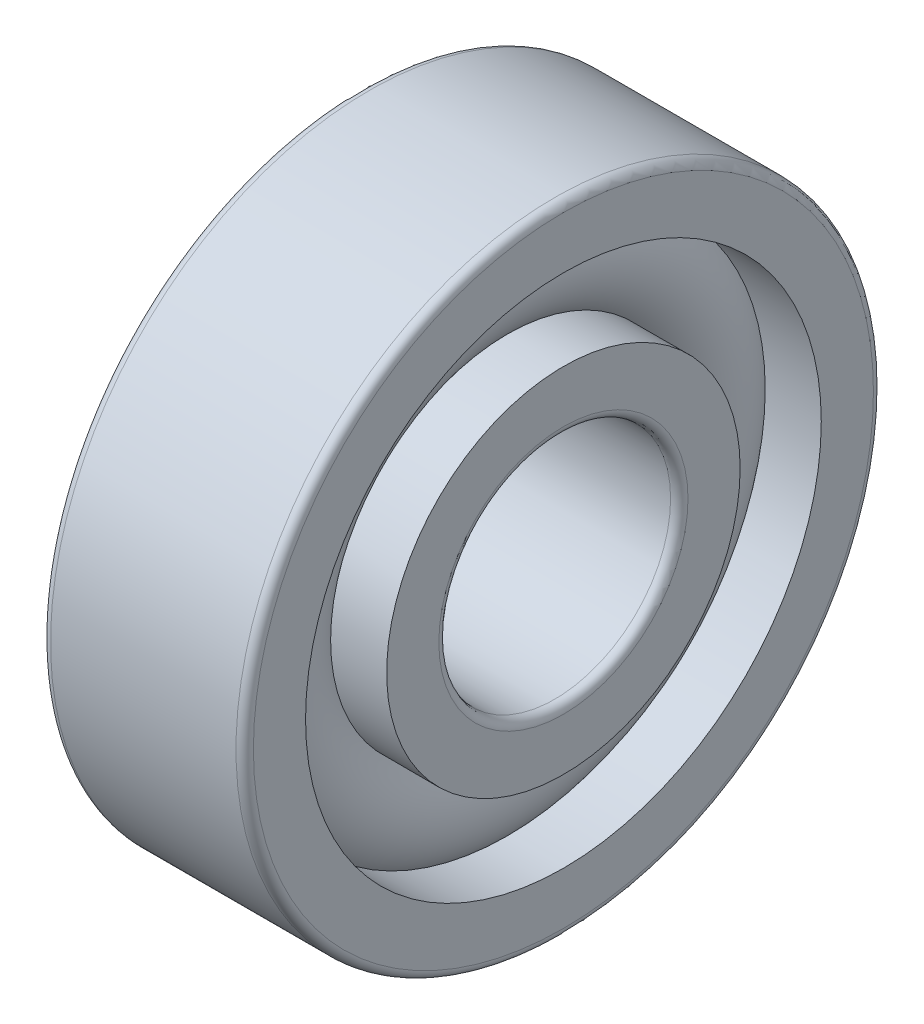
ISO-10303-21;
HEADER;
FILE_DESCRIPTION(('STEP AP214'),'2;1');
FILE_NAME('part.step','',(''),(''),'','','');
FILE_SCHEMA(('AUTOMOTIVE_DESIGN { 1 0 10303 214 1 1 1 1 }'));
ENDSEC;
DATA;
#1=APPLICATION_CONTEXT('core data for automotive mechanical design processes');
#2=APPLICATION_PROTOCOL_DEFINITION('international standard','automotive_design',2000,#1);
#3=PRODUCT_CONTEXT('',#1,'mechanical');
#4=PRODUCT('Part','Part','',(#3));
#5=PRODUCT_RELATED_PRODUCT_CATEGORY('part','',(#4));
#6=PRODUCT_DEFINITION_FORMATION('','',#4);
#7=PRODUCT_DEFINITION_CONTEXT('part definition',#1,'design');
#8=PRODUCT_DEFINITION('design','',#6,#7);
#9=PRODUCT_DEFINITION_SHAPE('','',#8);
#10=(LENGTH_UNIT() NAMED_UNIT(*) SI_UNIT(.MILLI.,.METRE.));
#11=(NAMED_UNIT(*) PLANE_ANGLE_UNIT() SI_UNIT($,.RADIAN.));
#12=(NAMED_UNIT(*) SI_UNIT($,.STERADIAN.) SOLID_ANGLE_UNIT());
#13=UNCERTAINTY_MEASURE_WITH_UNIT(LENGTH_MEASURE(1.E-05),#10,'distance_accuracy_value','');
#14=(GEOMETRIC_REPRESENTATION_CONTEXT(3) GLOBAL_UNCERTAINTY_ASSIGNED_CONTEXT((#13)) GLOBAL_UNIT_ASSIGNED_CONTEXT((#10,
#11,#12)) REPRESENTATION_CONTEXT('',''));
#15=CARTESIAN_POINT('',(0.,0.,0.));
#16=DIRECTION('',(0.,0.,1.));
#17=DIRECTION('',(1.,0.,0.));
#18=AXIS2_PLACEMENT_3D('',#15,#16,#17);
#19=CARTESIAN_POINT('',(0.,0.,0.));
#20=DIRECTION('',(-1.,0.,0.));
#21=DIRECTION('',(0.,0.,1.));
#22=AXIS2_PLACEMENT_3D('',#19,#20,#21);
#23=TOROIDAL_SURFACE('',#22,7.5,2.1);
#24=CARTESIAN_POINT('',(1.56524758424985,0.,0.));
#25=DIRECTION('',(-1.,0.,0.));
#26=DIRECTION('',(0.,0.,1.));
#27=AXIS2_PLACEMENT_3D('',#24,#25,#26);
#28=CIRCLE('',#27,8.90000000000001);
#29=CARTESIAN_POINT('',(1.56524758424985,0.,8.90000000000001));
#30=VERTEX_POINT('',#29);
#31=EDGE_CURVE('E36',#30,#30,#28,.F.);
#32=ORIENTED_EDGE('',*,*,#31,.T.);
#33=EDGE_LOOP('',(#32));
#34=FACE_BOUND('',#33,.T.);
#35=CARTESIAN_POINT('',(1.56524758424985,0.,0.));
#36=DIRECTION('',(-1.,0.,0.));
#37=DIRECTION('',(0.,0.,1.));
#38=AXIS2_PLACEMENT_3D('',#35,#36,#37);
#39=CIRCLE('',#38,6.1);
#40=CARTESIAN_POINT('',(1.56524758424985,0.,6.1));
#41=VERTEX_POINT('',#40);
#42=EDGE_CURVE('E10',#41,#41,#39,.T.);
#43=ORIENTED_EDGE('',*,*,#42,.T.);
#44=EDGE_LOOP('',(#43));
#45=FACE_BOUND('',#44,.T.);
#46=ADVANCED_FACE('F32',(#34,#45),#23,.T.);
#47=CARTESIAN_POINT('',(-20.6375,0.,0.));
#48=DIRECTION('',(1.,0.,0.));
#49=DIRECTION('',(0.,0.,-1.));
#50=AXIS2_PLACEMENT_3D('',#47,#48,#49);
#51=CYLINDRICAL_SURFACE('',#50,6.1);
#52=CARTESIAN_POINT('',(3.5,0.,0.));
#53=DIRECTION('',(1.,0.,0.));
#54=DIRECTION('',(0.,0.,-1.));
#55=AXIS2_PLACEMENT_3D('',#52,#53,#54);
#56=CIRCLE('',#55,6.1);
#57=CARTESIAN_POINT('',(3.5,0.,-6.1));
#58=VERTEX_POINT('',#57);
#59=EDGE_CURVE('E45',#58,#58,#56,.T.);
#60=ORIENTED_EDGE('',*,*,#59,.F.);
#61=EDGE_LOOP('',(#60));
#62=FACE_BOUND('',#61,.T.);
#63=ORIENTED_EDGE('',*,*,#42,.F.);
#64=EDGE_LOOP('',(#63));
#65=FACE_BOUND('',#64,.T.);
#66=ADVANCED_FACE('F84',(#62,#65),#51,.T.);
#67=CARTESIAN_POINT('',(-20.6375,0.,0.));
#68=DIRECTION('',(1.,0.,0.));
#69=DIRECTION('',(0.,0.,-1.));
#70=AXIS2_PLACEMENT_3D('',#67,#68,#69);
#71=CYLINDRICAL_SURFACE('',#70,6.1);
#72=CARTESIAN_POINT('',(-3.5,0.,0.));
#73=DIRECTION('',(1.,0.,0.));
#74=DIRECTION('',(0.,0.,-1.));
#75=AXIS2_PLACEMENT_3D('',#72,#73,#74);
#76=CIRCLE('',#75,6.1);
#77=CARTESIAN_POINT('',(-3.5,0.,-6.1));
#78=VERTEX_POINT('',#77);
#79=EDGE_CURVE('E54',#78,#78,#76,.T.);
#80=ORIENTED_EDGE('',*,*,#79,.T.);
#81=EDGE_LOOP('',(#80));
#82=FACE_BOUND('',#81,.T.);
#83=CARTESIAN_POINT('',(-1.56524758424985,0.,0.));
#84=DIRECTION('',(1.,0.,0.));
#85=DIRECTION('',(0.,0.,-1.));
#86=AXIS2_PLACEMENT_3D('',#83,#84,#85);
#87=CIRCLE('',#86,6.1);
#88=CARTESIAN_POINT('',(-1.56524758424985,0.,-6.1));
#89=VERTEX_POINT('',#88);
#90=EDGE_CURVE('E40',#89,#89,#87,.T.);
#91=ORIENTED_EDGE('',*,*,#90,.F.);
#92=EDGE_LOOP('',(#91));
#93=FACE_BOUND('',#92,.T.);
#94=ADVANCED_FACE('F87',(#82,#93),#71,.T.);
#95=CARTESIAN_POINT('',(3.5,4.3,0.));
#96=DIRECTION('',(1.,0.,0.));
#97=DIRECTION('',(0.,0.,-1.));
#98=AXIS2_PLACEMENT_3D('',#95,#96,#97);
#99=PLANE('',#98);
#100=ORIENTED_EDGE('',*,*,#59,.T.);
#101=EDGE_LOOP('',(#100));
#102=FACE_BOUND('',#101,.T.);
#103=CARTESIAN_POINT('',(3.5,0.,0.));
#104=DIRECTION('',(1.,0.,0.));
#105=DIRECTION('',(0.,0.,-1.));
#106=AXIS2_PLACEMENT_3D('',#103,#104,#105);
#107=CIRCLE('',#106,4.3);
#108=CARTESIAN_POINT('',(3.5,0.,-4.3));
#109=VERTEX_POINT('',#108);
#110=EDGE_CURVE('E76',#109,#109,#107,.T.);
#111=ORIENTED_EDGE('',*,*,#110,.F.);
#112=EDGE_LOOP('',(#111));
#113=FACE_BOUND('',#112,.T.);
#114=ADVANCED_FACE('F81',(#102,#113),#99,.T.);
#115=CARTESIAN_POINT('',(3.2,0.,0.));
#116=DIRECTION('',(1.,0.,0.));
#117=DIRECTION('',(0.,0.,-1.));
#118=AXIS2_PLACEMENT_3D('',#115,#116,#117);
#119=TOROIDAL_SURFACE('',#118,4.3,0.3);
#120=ORIENTED_EDGE('',*,*,#110,.T.);
#121=EDGE_LOOP('',(#120));
#122=FACE_BOUND('',#121,.T.);
#123=CARTESIAN_POINT('',(3.2,0.,0.));
#124=DIRECTION('',(1.,0.,0.));
#125=DIRECTION('',(0.,0.,-1.));
#126=AXIS2_PLACEMENT_3D('',#123,#124,#125);
#127=CIRCLE('',#126,4.);
#128=CARTESIAN_POINT('',(3.2,0.,-4.));
#129=VERTEX_POINT('',#128);
#130=EDGE_CURVE('E73',#129,#129,#127,.T.);
#131=ORIENTED_EDGE('',*,*,#130,.F.);
#132=EDGE_LOOP('',(#131));
#133=FACE_BOUND('',#132,.T.);
#134=ADVANCED_FACE('F98',(#122,#133),#119,.T.);
#135=CARTESIAN_POINT('',(-20.6375,0.,0.));
#136=DIRECTION('',(1.,0.,0.));
#137=DIRECTION('',(0.,0.,-1.));
#138=AXIS2_PLACEMENT_3D('',#135,#136,#137);
#139=CYLINDRICAL_SURFACE('',#138,4.);
#140=ORIENTED_EDGE('',*,*,#130,.T.);
#141=EDGE_LOOP('',(#140));
#142=FACE_BOUND('',#141,.T.);
#143=CARTESIAN_POINT('',(-3.2,0.,0.));
#144=DIRECTION('',(1.,0.,0.));
#145=DIRECTION('',(0.,0.,-1.));
#146=AXIS2_PLACEMENT_3D('',#143,#144,#145);
#147=CIRCLE('',#146,4.);
#148=CARTESIAN_POINT('',(-3.2,0.,-4.));
#149=VERTEX_POINT('',#148);
#150=EDGE_CURVE('E70',#149,#149,#147,.T.);
#151=ORIENTED_EDGE('',*,*,#150,.F.);
#152=EDGE_LOOP('',(#151));
#153=FACE_BOUND('',#152,.T.);
#154=ADVANCED_FACE('F101',(#142,#153),#139,.F.);
#155=CARTESIAN_POINT('',(-3.2,0.,0.));
#156=DIRECTION('',(1.,0.,0.));
#157=DIRECTION('',(0.,0.,-1.));
#158=AXIS2_PLACEMENT_3D('',#155,#156,#157);
#159=TOROIDAL_SURFACE('',#158,4.3,0.3);
#160=ORIENTED_EDGE('',*,*,#150,.T.);
#161=EDGE_LOOP('',(#160));
#162=FACE_BOUND('',#161,.T.);
#163=CARTESIAN_POINT('',(-3.5,0.,0.));
#164=DIRECTION('',(1.,0.,0.));
#165=DIRECTION('',(0.,0.,-1.));
#166=AXIS2_PLACEMENT_3D('',#163,#164,#165);
#167=CIRCLE('',#166,4.3);
#168=CARTESIAN_POINT('',(-3.5,0.,-4.3));
#169=VERTEX_POINT('',#168);
#170=EDGE_CURVE('E67',#169,#169,#167,.T.);
#171=ORIENTED_EDGE('',*,*,#170,.F.);
#172=EDGE_LOOP('',(#171));
#173=FACE_BOUND('',#172,.T.);
#174=ADVANCED_FACE('F105',(#162,#173),#159,.T.);
#175=CARTESIAN_POINT('',(-3.5,6.1,0.));
#176=DIRECTION('',(-1.,0.,0.));
#177=DIRECTION('',(0.,0.,1.));
#178=AXIS2_PLACEMENT_3D('',#175,#176,#177);
#179=PLANE('',#178);
#180=ORIENTED_EDGE('',*,*,#170,.T.);
#181=EDGE_LOOP('',(#180));
#182=FACE_BOUND('',#181,.T.);
#183=ORIENTED_EDGE('',*,*,#79,.F.);
#184=EDGE_LOOP('',(#183));
#185=FACE_BOUND('',#184,.T.);
#186=ADVANCED_FACE('F109',(#182,#185),#179,.T.);
#187=CARTESIAN_POINT('',(-1.56524758424985,0.,0.));
#188=DIRECTION('',(1.,0.,0.));
#189=DIRECTION('',(0.,0.,-1.));
#190=AXIS2_PLACEMENT_3D('',#187,#188,#189);
#191=CIRCLE('',#190,8.90000000000001);
#192=CARTESIAN_POINT('',(-1.56524758424985,0.,-8.90000000000001));
#193=VERTEX_POINT('',#192);
#194=EDGE_CURVE('E48',#193,#193,#191,.F.);
#195=ORIENTED_EDGE('',*,*,#194,.T.);
#196=EDGE_LOOP('',(#195));
#197=FACE_BOUND('',#196,.T.);
#198=ORIENTED_EDGE('',*,*,#90,.T.);
#199=EDGE_LOOP('',(#198));
#200=FACE_BOUND('',#199,.T.);
#201=ADVANCED_FACE('F34',(#197,#200),#23,.T.);
#202=CARTESIAN_POINT('',(-20.6375,0.,0.));
#203=DIRECTION('',(1.,0.,0.));
#204=DIRECTION('',(0.,0.,-1.));
#205=AXIS2_PLACEMENT_3D('',#202,#203,#204);
#206=CYLINDRICAL_SURFACE('',#205,8.90000000000001);
#207=CARTESIAN_POINT('',(3.5,0.,0.));
#208=DIRECTION('',(1.,0.,0.));
#209=DIRECTION('',(0.,0.,-1.));
#210=AXIS2_PLACEMENT_3D('',#207,#208,#209);
#211=CIRCLE('',#210,8.90000000000001);
#212=CARTESIAN_POINT('',(3.5,0.,-8.90000000000001));
#213=VERTEX_POINT('',#212);
#214=EDGE_CURVE('E50',#213,#213,#211,.T.);
#215=ORIENTED_EDGE('',*,*,#214,.T.);
#216=EDGE_LOOP('',(#215));
#217=FACE_BOUND('',#216,.T.);
#218=ORIENTED_EDGE('',*,*,#31,.F.);
#219=EDGE_LOOP('',(#218));
#220=FACE_BOUND('',#219,.T.);
#221=ADVANCED_FACE('F114',(#217,#220),#206,.F.);
#222=CARTESIAN_POINT('',(-20.6375,0.,0.));
#223=DIRECTION('',(1.,0.,0.));
#224=DIRECTION('',(0.,0.,-1.));
#225=AXIS2_PLACEMENT_3D('',#222,#223,#224);
#226=CYLINDRICAL_SURFACE('',#225,8.90000000000001);
#227=CARTESIAN_POINT('',(-3.5,0.,0.));
#228=DIRECTION('',(1.,0.,0.));
#229=DIRECTION('',(0.,0.,-1.));
#230=AXIS2_PLACEMENT_3D('',#227,#228,#229);
#231=CIRCLE('',#230,8.90000000000001);
#232=CARTESIAN_POINT('',(-3.5,0.,-8.90000000000001));
#233=VERTEX_POINT('',#232);
#234=EDGE_CURVE('E145',#233,#233,#231,.T.);
#235=ORIENTED_EDGE('',*,*,#234,.F.);
#236=EDGE_LOOP('',(#235));
#237=FACE_BOUND('',#236,.T.);
#238=ORIENTED_EDGE('',*,*,#194,.F.);
#239=EDGE_LOOP('',(#238));
#240=FACE_BOUND('',#239,.T.);
#241=ADVANCED_FACE('F117',(#237,#240),#226,.F.);
#242=CARTESIAN_POINT('',(3.5,10.7,0.));
#243=DIRECTION('',(1.,0.,0.));
#244=DIRECTION('',(0.,0.,-1.));
#245=AXIS2_PLACEMENT_3D('',#242,#243,#244);
#246=PLANE('',#245);
#247=CARTESIAN_POINT('',(3.5,0.,0.));
#248=DIRECTION('',(1.,0.,0.));
#249=DIRECTION('',(0.,0.,-1.));
#250=AXIS2_PLACEMENT_3D('',#247,#248,#249);
#251=CIRCLE('',#250,10.7);
#252=CARTESIAN_POINT('',(3.5,0.,-10.7));
#253=VERTEX_POINT('',#252);
#254=EDGE_CURVE('E56',#253,#253,#251,.T.);
#255=ORIENTED_EDGE('',*,*,#254,.T.);
#256=EDGE_LOOP('',(#255));
#257=FACE_BOUND('',#256,.T.);
#258=ORIENTED_EDGE('',*,*,#214,.F.);
#259=EDGE_LOOP('',(#258));
#260=FACE_BOUND('',#259,.T.);
#261=ADVANCED_FACE('F118',(#257,#260),#246,.T.);
#262=CARTESIAN_POINT('',(3.2,0.,0.));
#263=DIRECTION('',(1.,0.,0.));
#264=DIRECTION('',(0.,0.,-1.));
#265=AXIS2_PLACEMENT_3D('',#262,#263,#264);
#266=TOROIDAL_SURFACE('',#265,10.7,0.3);
#267=CARTESIAN_POINT('',(3.2,0.,0.));
#268=DIRECTION('',(1.,0.,0.));
#269=DIRECTION('',(0.,0.,-1.));
#270=AXIS2_PLACEMENT_3D('',#267,#268,#269);
#271=CIRCLE('',#270,11.);
#272=CARTESIAN_POINT('',(3.2,0.,-11.));
#273=VERTEX_POINT('',#272);
#274=EDGE_CURVE('E61',#273,#273,#271,.T.);
#275=ORIENTED_EDGE('',*,*,#274,.T.);
#276=EDGE_LOOP('',(#275));
#277=FACE_BOUND('',#276,.T.);
#278=ORIENTED_EDGE('',*,*,#254,.F.);
#279=EDGE_LOOP('',(#278));
#280=FACE_BOUND('',#279,.T.);
#281=ADVANCED_FACE('F121',(#277,#280),#266,.T.);
#282=CARTESIAN_POINT('',(-20.6375,0.,0.));
#283=DIRECTION('',(1.,0.,0.));
#284=DIRECTION('',(0.,0.,-1.));
#285=AXIS2_PLACEMENT_3D('',#282,#283,#284);
#286=CYLINDRICAL_SURFACE('',#285,11.);
#287=CARTESIAN_POINT('',(-3.2,0.,0.));
#288=DIRECTION('',(1.,0.,0.));
#289=DIRECTION('',(0.,0.,-1.));
#290=AXIS2_PLACEMENT_3D('',#287,#288,#289);
#291=CIRCLE('',#290,11.);
#292=CARTESIAN_POINT('',(-3.2,0.,-11.));
#293=VERTEX_POINT('',#292);
#294=EDGE_CURVE('E149',#293,#293,#291,.T.);
#295=ORIENTED_EDGE('',*,*,#294,.T.);
#296=EDGE_LOOP('',(#295));
#297=FACE_BOUND('',#296,.T.);
#298=ORIENTED_EDGE('',*,*,#274,.F.);
#299=EDGE_LOOP('',(#298));
#300=FACE_BOUND('',#299,.T.);
#301=ADVANCED_FACE('F125',(#297,#300),#286,.T.);
#302=CARTESIAN_POINT('',(-3.2,0.,0.));
#303=DIRECTION('',(1.,0.,0.));
#304=DIRECTION('',(0.,0.,-1.));
#305=AXIS2_PLACEMENT_3D('',#302,#303,#304);
#306=TOROIDAL_SURFACE('',#305,10.7,0.3);
#307=CARTESIAN_POINT('',(-3.5,0.,0.));
#308=DIRECTION('',(1.,0.,0.));
#309=DIRECTION('',(0.,0.,-1.));
#310=AXIS2_PLACEMENT_3D('',#307,#308,#309);
#311=CIRCLE('',#310,10.7);
#312=CARTESIAN_POINT('',(-3.5,0.,-10.7));
#313=VERTEX_POINT('',#312);
#314=EDGE_CURVE('E146',#313,#313,#311,.T.);
#315=ORIENTED_EDGE('',*,*,#314,.T.);
#316=EDGE_LOOP('',(#315));
#317=FACE_BOUND('',#316,.T.);
#318=ORIENTED_EDGE('',*,*,#294,.F.);
#319=EDGE_LOOP('',(#318));
#320=FACE_BOUND('',#319,.T.);
#321=ADVANCED_FACE('F129',(#317,#320),#306,.T.);
#322=CARTESIAN_POINT('',(-3.5,8.90000000000001,0.));
#323=DIRECTION('',(-1.,0.,0.));
#324=DIRECTION('',(0.,0.,1.));
#325=AXIS2_PLACEMENT_3D('',#322,#323,#324);
#326=PLANE('',#325);
#327=ORIENTED_EDGE('',*,*,#234,.T.);
#328=EDGE_LOOP('',(#327));
#329=FACE_BOUND('',#328,.T.);
#330=ORIENTED_EDGE('',*,*,#314,.F.);
#331=EDGE_LOOP('',(#330));
#332=FACE_BOUND('',#331,.T.);
#333=ADVANCED_FACE('F133',(#329,#332),#326,.T.);
#334=CLOSED_SHELL('',(#46,#66,#94,#114,#134,#154,#174,#186,#201,#221,#241,#261,#281,#301,#321,#333));
#335=MANIFOLD_SOLID_BREP('B2',#334);
#336=ADVANCED_BREP_SHAPE_REPRESENTATION('',(#18,#335),#14);
#337=SHAPE_DEFINITION_REPRESENTATION(#9,#336);
ENDSEC;
END-ISO-10303-21;
